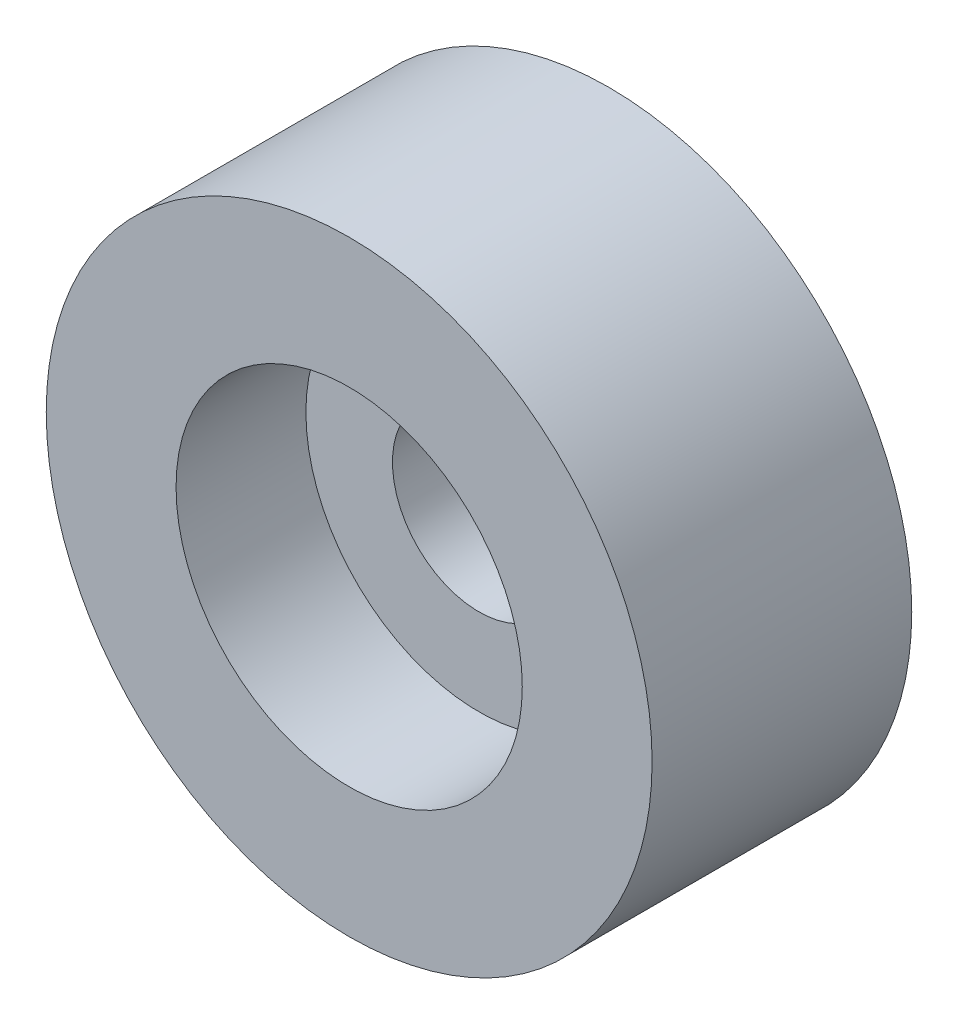
ISO-10303-21;
HEADER;
FILE_DESCRIPTION(('STEP AP214'),'2;1');
FILE_NAME('part.step','',(''),(''),'','','');
FILE_SCHEMA(('AUTOMOTIVE_DESIGN { 1 0 10303 214 1 1 1 1 }'));
ENDSEC;
DATA;
#1=APPLICATION_CONTEXT('core data for automotive mechanical design processes');
#2=APPLICATION_PROTOCOL_DEFINITION('international standard','automotive_design',2000,#1);
#3=PRODUCT_CONTEXT('',#1,'mechanical');
#4=PRODUCT('Part','Part','',(#3));
#5=PRODUCT_RELATED_PRODUCT_CATEGORY('part','',(#4));
#6=PRODUCT_DEFINITION_FORMATION('','',#4);
#7=PRODUCT_DEFINITION_CONTEXT('part definition',#1,'design');
#8=PRODUCT_DEFINITION('design','',#6,#7);
#9=PRODUCT_DEFINITION_SHAPE('','',#8);
#10=(LENGTH_UNIT() NAMED_UNIT(*) SI_UNIT(.MILLI.,.METRE.));
#11=(NAMED_UNIT(*) PLANE_ANGLE_UNIT() SI_UNIT($,.RADIAN.));
#12=(NAMED_UNIT(*) SI_UNIT($,.STERADIAN.) SOLID_ANGLE_UNIT());
#13=UNCERTAINTY_MEASURE_WITH_UNIT(LENGTH_MEASURE(1.E-05),#10,'distance_accuracy_value','');
#14=(GEOMETRIC_REPRESENTATION_CONTEXT(3) GLOBAL_UNCERTAINTY_ASSIGNED_CONTEXT((#13)) GLOBAL_UNIT_ASSIGNED_CONTEXT((#10,
#11,#12)) REPRESENTATION_CONTEXT('',''));
#15=CARTESIAN_POINT('',(0.,0.,0.));
#16=DIRECTION('',(0.,0.,1.));
#17=DIRECTION('',(1.,0.,0.));
#18=AXIS2_PLACEMENT_3D('',#15,#16,#17);
#19=CARTESIAN_POINT('',(0.,0.,3.));
#20=DIRECTION('',(0.,0.,-1.));
#21=DIRECTION('',(-1.,0.,0.));
#22=AXIS2_PLACEMENT_3D('',#19,#20,#21);
#23=CYLINDRICAL_SURFACE('',#22,1.);
#24=CARTESIAN_POINT('',(0.,0.,0.));
#25=DIRECTION('',(0.,0.,1.));
#26=DIRECTION('',(1.,0.,0.));
#27=AXIS2_PLACEMENT_3D('',#24,#25,#26);
#28=CIRCLE('',#27,1.);
#29=CARTESIAN_POINT('',(1.,0.,0.));
#30=VERTEX_POINT('',#29);
#31=EDGE_CURVE('E47',#30,#30,#28,.T.);
#32=ORIENTED_EDGE('',*,*,#31,.F.);
#33=EDGE_LOOP('',(#32));
#34=FACE_BOUND('',#33,.T.);
#35=CARTESIAN_POINT('',(0.,0.,1.5));
#36=DIRECTION('',(0.,0.,1.));
#37=DIRECTION('',(1.,0.,0.));
#38=AXIS2_PLACEMENT_3D('',#35,#36,#37);
#39=CIRCLE('',#38,1.);
#40=CARTESIAN_POINT('',(1.,0.,1.5));
#41=VERTEX_POINT('',#40);
#42=EDGE_CURVE('E38',#41,#41,#39,.T.);
#43=ORIENTED_EDGE('',*,*,#42,.T.);
#44=EDGE_LOOP('',(#43));
#45=FACE_BOUND('',#44,.T.);
#46=ADVANCED_FACE('F34',(#34,#45),#23,.F.);
#47=CARTESIAN_POINT('',(0.,0.,3.));
#48=DIRECTION('',(0.,0.,1.));
#49=DIRECTION('',(1.,0.,0.));
#50=AXIS2_PLACEMENT_3D('',#47,#48,#49);
#51=PLANE('',#50);
#52=CARTESIAN_POINT('',(0.,0.,3.));
#53=DIRECTION('',(0.,0.,1.));
#54=DIRECTION('',(1.,0.,0.));
#55=AXIS2_PLACEMENT_3D('',#52,#53,#54);
#56=CIRCLE('',#55,2.);
#57=CARTESIAN_POINT('',(2.,0.,3.));
#58=VERTEX_POINT('',#57);
#59=EDGE_CURVE('E51',#58,#58,#56,.T.);
#60=ORIENTED_EDGE('',*,*,#59,.F.);
#61=EDGE_LOOP('',(#60));
#62=FACE_BOUND('',#61,.T.);
#63=CARTESIAN_POINT('',(0.,0.,3.));
#64=DIRECTION('',(0.,0.,1.));
#65=DIRECTION('',(1.,0.,0.));
#66=AXIS2_PLACEMENT_3D('',#63,#64,#65);
#67=CIRCLE('',#66,3.5);
#68=CARTESIAN_POINT('',(3.5,0.,3.));
#69=VERTEX_POINT('',#68);
#70=EDGE_CURVE('E10',#69,#69,#67,.T.);
#71=ORIENTED_EDGE('',*,*,#70,.T.);
#72=EDGE_LOOP('',(#71));
#73=FACE_BOUND('',#72,.T.);
#74=ADVANCED_FACE('F72',(#62,#73),#51,.T.);
#75=CARTESIAN_POINT('',(0.,0.,0.));
#76=DIRECTION('',(0.,0.,1.));
#77=DIRECTION('',(1.,0.,0.));
#78=AXIS2_PLACEMENT_3D('',#75,#76,#77);
#79=PLANE('',#78);
#80=CARTESIAN_POINT('',(0.,0.,0.));
#81=DIRECTION('',(0.,0.,1.));
#82=DIRECTION('',(1.,0.,0.));
#83=AXIS2_PLACEMENT_3D('',#80,#81,#82);
#84=CIRCLE('',#83,3.5);
#85=CARTESIAN_POINT('',(3.5,0.,0.));
#86=VERTEX_POINT('',#85);
#87=EDGE_CURVE('E42',#86,#86,#84,.T.);
#88=ORIENTED_EDGE('',*,*,#87,.F.);
#89=EDGE_LOOP('',(#88));
#90=FACE_BOUND('',#89,.T.);
#91=ORIENTED_EDGE('',*,*,#31,.T.);
#92=EDGE_LOOP('',(#91));
#93=FACE_BOUND('',#92,.T.);
#94=ADVANCED_FACE('F78',(#90,#93),#79,.F.);
#95=CARTESIAN_POINT('',(0.,0.,3.));
#96=DIRECTION('',(0.,0.,-1.));
#97=DIRECTION('',(-1.,0.,0.));
#98=AXIS2_PLACEMENT_3D('',#95,#96,#97);
#99=CYLINDRICAL_SURFACE('',#98,3.5);
#100=ORIENTED_EDGE('',*,*,#70,.F.);
#101=EDGE_LOOP('',(#100));
#102=FACE_BOUND('',#101,.T.);
#103=ORIENTED_EDGE('',*,*,#87,.T.);
#104=EDGE_LOOP('',(#103));
#105=FACE_BOUND('',#104,.T.);
#106=ADVANCED_FACE('F36',(#102,#105),#99,.T.);
#107=CARTESIAN_POINT('',(0.,0.,1.5));
#108=DIRECTION('',(0.,0.,1.));
#109=DIRECTION('',(1.,0.,0.));
#110=AXIS2_PLACEMENT_3D('',#107,#108,#109);
#111=CYLINDRICAL_SURFACE('',#110,2.);
#112=CARTESIAN_POINT('',(0.,0.,1.5));
#113=DIRECTION('',(0.,0.,1.));
#114=DIRECTION('',(1.,0.,0.));
#115=AXIS2_PLACEMENT_3D('',#112,#113,#114);
#116=CIRCLE('',#115,2.);
#117=CARTESIAN_POINT('',(2.,0.,1.5));
#118=VERTEX_POINT('',#117);
#119=EDGE_CURVE('E54',#118,#118,#116,.T.);
#120=ORIENTED_EDGE('',*,*,#119,.F.);
#121=EDGE_LOOP('',(#120));
#122=FACE_BOUND('',#121,.T.);
#123=ORIENTED_EDGE('',*,*,#59,.T.);
#124=EDGE_LOOP('',(#123));
#125=FACE_BOUND('',#124,.T.);
#126=ADVANCED_FACE('F64',(#122,#125),#111,.F.);
#127=CARTESIAN_POINT('',(0.,0.,1.5));
#128=DIRECTION('',(0.,0.,1.));
#129=DIRECTION('',(1.,0.,0.));
#130=AXIS2_PLACEMENT_3D('',#127,#128,#129);
#131=PLANE('',#130);
#132=ORIENTED_EDGE('',*,*,#42,.F.);
#133=EDGE_LOOP('',(#132));
#134=FACE_BOUND('',#133,.T.);
#135=ORIENTED_EDGE('',*,*,#119,.T.);
#136=EDGE_LOOP('',(#135));
#137=FACE_BOUND('',#136,.T.);
#138=ADVANCED_FACE('F62',(#134,#137),#131,.T.);
#139=CLOSED_SHELL('',(#46,#74,#94,#106,#126,#138));
#140=MANIFOLD_SOLID_BREP('B2',#139);
#141=ADVANCED_BREP_SHAPE_REPRESENTATION('',(#18,#140),#14);
#142=SHAPE_DEFINITION_REPRESENTATION(#9,#141);
ENDSEC;
END-ISO-10303-21;
